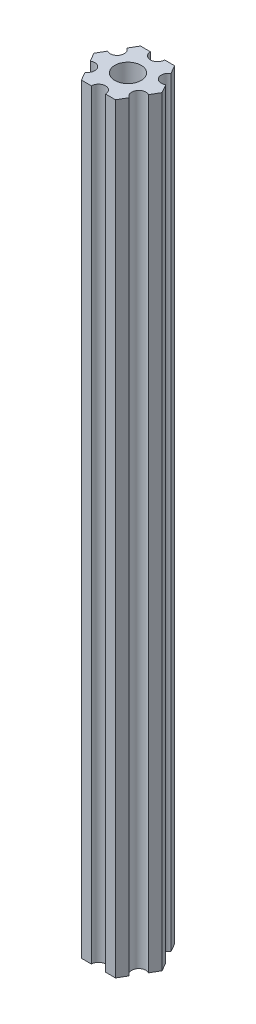
ISO-10303-21;
HEADER;
FILE_DESCRIPTION(('STEP AP214'),'2;1');
FILE_NAME('part.step','',(''),(''),'','','');
FILE_SCHEMA(('AUTOMOTIVE_DESIGN { 1 0 10303 214 1 1 1 1 }'));
ENDSEC;
DATA;
#1=APPLICATION_CONTEXT('core data for automotive mechanical design processes');
#2=APPLICATION_PROTOCOL_DEFINITION('international standard','automotive_design',2000,#1);
#3=PRODUCT_CONTEXT('',#1,'mechanical');
#4=PRODUCT('Part','Part','',(#3));
#5=PRODUCT_RELATED_PRODUCT_CATEGORY('part','',(#4));
#6=PRODUCT_DEFINITION_FORMATION('','',#4);
#7=PRODUCT_DEFINITION_CONTEXT('part definition',#1,'design');
#8=PRODUCT_DEFINITION('design','',#6,#7);
#9=PRODUCT_DEFINITION_SHAPE('','',#8);
#10=(LENGTH_UNIT() NAMED_UNIT(*) SI_UNIT(.MILLI.,.METRE.));
#11=(NAMED_UNIT(*) PLANE_ANGLE_UNIT() SI_UNIT($,.RADIAN.));
#12=(NAMED_UNIT(*) SI_UNIT($,.STERADIAN.) SOLID_ANGLE_UNIT());
#13=UNCERTAINTY_MEASURE_WITH_UNIT(LENGTH_MEASURE(1.E-05),#10,'distance_accuracy_value','');
#14=(GEOMETRIC_REPRESENTATION_CONTEXT(3) GLOBAL_UNCERTAINTY_ASSIGNED_CONTEXT((#13)) GLOBAL_UNIT_ASSIGNED_CONTEXT((#10,
#11,#12)) REPRESENTATION_CONTEXT('',''));
#15=CARTESIAN_POINT('',(0.,0.,0.));
#16=DIRECTION('',(0.,0.,1.));
#17=DIRECTION('',(1.,0.,0.));
#18=AXIS2_PLACEMENT_3D('',#15,#16,#17);
#19=CARTESIAN_POINT('',(5.41265877365274,-76.,3.125));
#20=DIRECTION('',(0.,1.,0.));
#21=DIRECTION('',(0.,0.,1.));
#22=AXIS2_PLACEMENT_3D('',#19,#20,#21);
#23=CYLINDRICAL_SURFACE('',#22,1.5);
#24=CARTESIAN_POINT('',(5.41265877365274,85.,3.125));
#25=DIRECTION('',(0.,-1.,0.));
#26=DIRECTION('',(0.,0.,-1.));
#27=AXIS2_PLACEMENT_3D('',#24,#25,#26);
#28=CIRCLE('',#27,1.5);
#29=CARTESIAN_POINT('',(4.66265877365274,85.,4.42403810567666));
#30=VERTEX_POINT('',#29);
#31=CARTESIAN_POINT('',(6.16265877365274,85.,1.82596189432335));
#32=VERTEX_POINT('',#31);
#33=EDGE_CURVE('E190',#30,#32,#28,.T.);
#34=ORIENTED_EDGE('',*,*,#33,.F.);
#35=DIRECTION('',(0.,1.,0.));
#36=VECTOR('',#35,1.);
#37=CARTESIAN_POINT('',(4.66265877365274,-76.,4.42403810567666));
#38=LINE('',#37,#36);
#39=CARTESIAN_POINT('',(4.66265877365274,-76.,4.42403810567666));
#40=VERTEX_POINT('',#39);
#41=EDGE_CURVE('E11',#40,#30,#38,.T.);
#42=ORIENTED_EDGE('',*,*,#41,.F.);
#43=CARTESIAN_POINT('',(5.41265877365274,-76.,3.125));
#44=DIRECTION('',(0.,-1.,0.));
#45=DIRECTION('',(0.,0.,-1.));
#46=AXIS2_PLACEMENT_3D('',#43,#44,#45);
#47=CIRCLE('',#46,1.5);
#48=CARTESIAN_POINT('',(6.16265877365274,-76.,1.82596189432335));
#49=VERTEX_POINT('',#48);
#50=EDGE_CURVE('E241',#40,#49,#47,.T.);
#51=ORIENTED_EDGE('',*,*,#50,.T.);
#52=DIRECTION('',(0.,1.,0.));
#53=VECTOR('',#52,1.);
#54=CARTESIAN_POINT('',(6.16265877365274,-76.,1.82596189432335));
#55=LINE('',#54,#53);
#56=EDGE_CURVE('E36',#49,#32,#55,.T.);
#57=ORIENTED_EDGE('',*,*,#56,.T.);
#58=EDGE_LOOP('',(#34,#42,#51,#57));
#59=FACE_BOUND('',#58,.T.);
#60=ADVANCED_FACE('F33',(#59),#23,.F.);
#61=CARTESIAN_POINT('',(3.60843918243516,-76.,6.25));
#62=DIRECTION('',(0.866025403784439,0.,0.5));
#63=DIRECTION('',(0.5,0.,-0.866025403784439));
#64=AXIS2_PLACEMENT_3D('',#61,#62,#63);
#65=PLANE('',#64);
#66=DIRECTION('',(0.5,0.,-0.866025403784439));
#67=VECTOR('',#66,1.);
#68=CARTESIAN_POINT('',(3.60843918243516,85.,6.25));
#69=LINE('',#68,#67);
#70=CARTESIAN_POINT('',(3.60843918243516,85.,6.25));
#71=VERTEX_POINT('',#70);
#72=EDGE_CURVE('E239',#71,#30,#69,.T.);
#73=ORIENTED_EDGE('',*,*,#72,.F.);
#74=DIRECTION('',(0.,1.,0.));
#75=VECTOR('',#74,1.);
#76=CARTESIAN_POINT('',(3.60843918243516,-76.,6.25));
#77=LINE('',#76,#75);
#78=CARTESIAN_POINT('',(3.60843918243516,-76.,6.25));
#79=VERTEX_POINT('',#78);
#80=EDGE_CURVE('E42',#79,#71,#77,.T.);
#81=ORIENTED_EDGE('',*,*,#80,.F.);
#82=DIRECTION('',(0.5,0.,-0.866025403784439));
#83=VECTOR('',#82,1.);
#84=CARTESIAN_POINT('',(3.60843918243516,-76.,6.25));
#85=LINE('',#84,#83);
#86=EDGE_CURVE('E180',#79,#40,#85,.T.);
#87=ORIENTED_EDGE('',*,*,#86,.T.);
#88=ORIENTED_EDGE('',*,*,#41,.T.);
#89=EDGE_LOOP('',(#73,#81,#87,#88));
#90=FACE_BOUND('',#89,.T.);
#91=ADVANCED_FACE('F273',(#90),#65,.T.);
#92=CARTESIAN_POINT('',(1.5,-76.,6.25));
#93=DIRECTION('',(0.,0.,1.));
#94=DIRECTION('',(1.,0.,0.));
#95=AXIS2_PLACEMENT_3D('',#92,#93,#94);
#96=PLANE('',#95);
#97=DIRECTION('',(1.,0.,0.));
#98=VECTOR('',#97,1.);
#99=CARTESIAN_POINT('',(1.5,85.,6.25));
#100=LINE('',#99,#98);
#101=CARTESIAN_POINT('',(1.5,85.,6.25));
#102=VERTEX_POINT('',#101);
#103=EDGE_CURVE('E167',#102,#71,#100,.T.);
#104=ORIENTED_EDGE('',*,*,#103,.F.);
#105=DIRECTION('',(0.,1.,0.));
#106=VECTOR('',#105,1.);
#107=CARTESIAN_POINT('',(1.5,-76.,6.25));
#108=LINE('',#107,#106);
#109=CARTESIAN_POINT('',(1.5,-76.,6.25));
#110=VERTEX_POINT('',#109);
#111=EDGE_CURVE('E162',#110,#102,#108,.T.);
#112=ORIENTED_EDGE('',*,*,#111,.F.);
#113=DIRECTION('',(1.,0.,0.));
#114=VECTOR('',#113,1.);
#115=CARTESIAN_POINT('',(1.5,-76.,6.25));
#116=LINE('',#115,#114);
#117=EDGE_CURVE('E165',#110,#79,#116,.T.);
#118=ORIENTED_EDGE('',*,*,#117,.T.);
#119=ORIENTED_EDGE('',*,*,#80,.T.);
#120=EDGE_LOOP('',(#104,#112,#118,#119));
#121=FACE_BOUND('',#120,.T.);
#122=ADVANCED_FACE('F164',(#121),#96,.T.);
#123=CARTESIAN_POINT('',(0.,-76.,6.25));
#124=DIRECTION('',(0.,1.,0.));
#125=DIRECTION('',(0.,0.,1.));
#126=AXIS2_PLACEMENT_3D('',#123,#124,#125);
#127=CYLINDRICAL_SURFACE('',#126,1.5);
#128=CARTESIAN_POINT('',(0.,85.,6.25));
#129=DIRECTION('',(0.,-1.,0.));
#130=DIRECTION('',(0.,0.,-1.));
#131=AXIS2_PLACEMENT_3D('',#128,#129,#130);
#132=CIRCLE('',#131,1.5);
#133=CARTESIAN_POINT('',(-1.5,85.,6.25));
#134=VERTEX_POINT('',#133);
#135=EDGE_CURVE('E236',#134,#102,#132,.T.);
#136=ORIENTED_EDGE('',*,*,#135,.F.);
#137=DIRECTION('',(0.,1.,0.));
#138=VECTOR('',#137,1.);
#139=CARTESIAN_POINT('',(-1.5,-76.,6.25));
#140=LINE('',#139,#138);
#141=CARTESIAN_POINT('',(-1.5,-76.,6.25));
#142=VERTEX_POINT('',#141);
#143=EDGE_CURVE('E172',#142,#134,#140,.T.);
#144=ORIENTED_EDGE('',*,*,#143,.F.);
#145=CARTESIAN_POINT('',(0.,-76.,6.25));
#146=DIRECTION('',(0.,-1.,0.));
#147=DIRECTION('',(0.,0.,-1.));
#148=AXIS2_PLACEMENT_3D('',#145,#146,#147);
#149=CIRCLE('',#148,1.5);
#150=EDGE_CURVE('E178',#142,#110,#149,.T.);
#151=ORIENTED_EDGE('',*,*,#150,.T.);
#152=ORIENTED_EDGE('',*,*,#111,.T.);
#153=EDGE_LOOP('',(#136,#144,#151,#152));
#154=FACE_BOUND('',#153,.T.);
#155=ADVANCED_FACE('F182',(#154),#127,.F.);
#156=CARTESIAN_POINT('',(-3.60843918243516,-76.,6.25));
#157=DIRECTION('',(0.,0.,1.));
#158=DIRECTION('',(1.,0.,0.));
#159=AXIS2_PLACEMENT_3D('',#156,#157,#158);
#160=PLANE('',#159);
#161=DIRECTION('',(1.,0.,0.));
#162=VECTOR('',#161,1.);
#163=CARTESIAN_POINT('',(-3.60843918243516,85.,6.25));
#164=LINE('',#163,#162);
#165=CARTESIAN_POINT('',(-3.60843918243516,85.,6.25));
#166=VERTEX_POINT('',#165);
#167=EDGE_CURVE('E233',#166,#134,#164,.T.);
#168=ORIENTED_EDGE('',*,*,#167,.F.);
#169=DIRECTION('',(0.,1.,0.));
#170=VECTOR('',#169,1.);
#171=CARTESIAN_POINT('',(-3.60843918243516,-76.,6.25));
#172=LINE('',#171,#170);
#173=CARTESIAN_POINT('',(-3.60843918243516,-76.,6.25));
#174=VERTEX_POINT('',#173);
#175=EDGE_CURVE('E245',#174,#166,#172,.T.);
#176=ORIENTED_EDGE('',*,*,#175,.F.);
#177=DIRECTION('',(1.,0.,0.));
#178=VECTOR('',#177,1.);
#179=CARTESIAN_POINT('',(-3.60843918243516,-76.,6.25));
#180=LINE('',#179,#178);
#181=EDGE_CURVE('E183',#174,#142,#180,.T.);
#182=ORIENTED_EDGE('',*,*,#181,.T.);
#183=ORIENTED_EDGE('',*,*,#143,.T.);
#184=EDGE_LOOP('',(#168,#176,#182,#183));
#185=FACE_BOUND('',#184,.T.);
#186=ADVANCED_FACE('F286',(#185),#160,.T.);
#187=CARTESIAN_POINT('',(-4.66265877365274,-76.,4.42403810567666));
#188=DIRECTION('',(-0.866025403784439,0.,0.5));
#189=DIRECTION('',(0.5,0.,0.866025403784439));
#190=AXIS2_PLACEMENT_3D('',#187,#188,#189);
#191=PLANE('',#190);
#192=DIRECTION('',(0.5,0.,0.866025403784439));
#193=VECTOR('',#192,1.);
#194=CARTESIAN_POINT('',(-4.66265877365274,85.,4.42403810567666));
#195=LINE('',#194,#193);
#196=CARTESIAN_POINT('',(-4.66265877365274,85.,4.42403810567666));
#197=VERTEX_POINT('',#196);
#198=EDGE_CURVE('E230',#197,#166,#195,.T.);
#199=ORIENTED_EDGE('',*,*,#198,.F.);
#200=DIRECTION('',(0.,1.,0.));
#201=VECTOR('',#200,1.);
#202=CARTESIAN_POINT('',(-4.66265877365274,-76.,4.42403810567666));
#203=LINE('',#202,#201);
#204=CARTESIAN_POINT('',(-4.66265877365274,-76.,4.42403810567666));
#205=VERTEX_POINT('',#204);
#206=EDGE_CURVE('E247',#205,#197,#203,.T.);
#207=ORIENTED_EDGE('',*,*,#206,.F.);
#208=DIRECTION('',(0.5,0.,0.866025403784439));
#209=VECTOR('',#208,1.);
#210=CARTESIAN_POINT('',(-4.66265877365274,-76.,4.42403810567666));
#211=LINE('',#210,#209);
#212=EDGE_CURVE('E185',#205,#174,#211,.T.);
#213=ORIENTED_EDGE('',*,*,#212,.T.);
#214=ORIENTED_EDGE('',*,*,#175,.T.);
#215=EDGE_LOOP('',(#199,#207,#213,#214));
#216=FACE_BOUND('',#215,.T.);
#217=ADVANCED_FACE('F289',(#216),#191,.T.);
#218=CARTESIAN_POINT('',(-5.41265877365274,-76.,3.125));
#219=DIRECTION('',(0.,1.,0.));
#220=DIRECTION('',(0.,0.,1.));
#221=AXIS2_PLACEMENT_3D('',#218,#219,#220);
#222=CYLINDRICAL_SURFACE('',#221,1.5);
#223=CARTESIAN_POINT('',(-5.41265877365274,85.,3.125));
#224=DIRECTION('',(0.,-1.,0.));
#225=DIRECTION('',(0.,0.,-1.));
#226=AXIS2_PLACEMENT_3D('',#223,#224,#225);
#227=CIRCLE('',#226,1.5);
#228=CARTESIAN_POINT('',(-6.16265877365274,85.,1.82596189432335));
#229=VERTEX_POINT('',#228);
#230=EDGE_CURVE('E227',#229,#197,#227,.T.);
#231=ORIENTED_EDGE('',*,*,#230,.F.);
#232=DIRECTION('',(0.,1.,0.));
#233=VECTOR('',#232,1.);
#234=CARTESIAN_POINT('',(-6.16265877365274,-76.,1.82596189432335));
#235=LINE('',#234,#233);
#236=CARTESIAN_POINT('',(-6.16265877365274,-76.,1.82596189432335));
#237=VERTEX_POINT('',#236);
#238=EDGE_CURVE('E249',#237,#229,#235,.T.);
#239=ORIENTED_EDGE('',*,*,#238,.F.);
#240=CARTESIAN_POINT('',(-5.41265877365274,-76.,3.125));
#241=DIRECTION('',(0.,-1.,0.));
#242=DIRECTION('',(0.,0.,-1.));
#243=AXIS2_PLACEMENT_3D('',#240,#241,#242);
#244=CIRCLE('',#243,1.5);
#245=EDGE_CURVE('E394',#237,#205,#244,.T.);
#246=ORIENTED_EDGE('',*,*,#245,.T.);
#247=ORIENTED_EDGE('',*,*,#206,.T.);
#248=EDGE_LOOP('',(#231,#239,#246,#247));
#249=FACE_BOUND('',#248,.T.);
#250=ADVANCED_FACE('F293',(#249),#222,.F.);
#251=CARTESIAN_POINT('',(-7.21687836487032,-76.,0.));
#252=DIRECTION('',(-0.86602540378444,0.,0.499999999999998));
#253=DIRECTION('',(0.499999999999998,0.,0.86602540378444));
#254=AXIS2_PLACEMENT_3D('',#251,#252,#253);
#255=PLANE('',#254);
#256=DIRECTION('',(0.499999999999998,0.,0.86602540378444));
#257=VECTOR('',#256,1.);
#258=CARTESIAN_POINT('',(-7.21687836487032,85.,0.));
#259=LINE('',#258,#257);
#260=CARTESIAN_POINT('',(-7.21687836487032,85.,0.));
#261=VERTEX_POINT('',#260);
#262=EDGE_CURVE('E224',#261,#229,#259,.T.);
#263=ORIENTED_EDGE('',*,*,#262,.F.);
#264=DIRECTION('',(0.,1.,0.));
#265=VECTOR('',#264,1.);
#266=CARTESIAN_POINT('',(-7.21687836487032,-76.,0.));
#267=LINE('',#266,#265);
#268=CARTESIAN_POINT('',(-7.21687836487032,-76.,0.));
#269=VERTEX_POINT('',#268);
#270=EDGE_CURVE('E251',#269,#261,#267,.T.);
#271=ORIENTED_EDGE('',*,*,#270,.F.);
#272=DIRECTION('',(0.499999999999998,0.,0.86602540378444));
#273=VECTOR('',#272,1.);
#274=CARTESIAN_POINT('',(-7.21687836487032,-76.,0.));
#275=LINE('',#274,#273);
#276=EDGE_CURVE('E391',#269,#237,#275,.T.);
#277=ORIENTED_EDGE('',*,*,#276,.T.);
#278=ORIENTED_EDGE('',*,*,#238,.T.);
#279=EDGE_LOOP('',(#263,#271,#277,#278));
#280=FACE_BOUND('',#279,.T.);
#281=ADVANCED_FACE('F297',(#280),#255,.T.);
#282=CARTESIAN_POINT('',(-6.16265877365274,-76.,-1.82596189432334));
#283=DIRECTION('',(-0.866025403784438,0.,-0.5));
#284=DIRECTION('',(-0.5,0.,0.866025403784438));
#285=AXIS2_PLACEMENT_3D('',#282,#283,#284);
#286=PLANE('',#285);
#287=DIRECTION('',(-0.5,0.,0.866025403784438));
#288=VECTOR('',#287,1.);
#289=CARTESIAN_POINT('',(-6.16265877365274,85.,-1.82596189432334));
#290=LINE('',#289,#288);
#291=CARTESIAN_POINT('',(-6.16265877365274,85.,-1.82596189432334));
#292=VERTEX_POINT('',#291);
#293=EDGE_CURVE('E221',#292,#261,#290,.T.);
#294=ORIENTED_EDGE('',*,*,#293,.F.);
#295=DIRECTION('',(0.,1.,0.));
#296=VECTOR('',#295,1.);
#297=CARTESIAN_POINT('',(-6.16265877365274,-76.,-1.82596189432334));
#298=LINE('',#297,#296);
#299=CARTESIAN_POINT('',(-6.16265877365274,-76.,-1.82596189432334));
#300=VERTEX_POINT('',#299);
#301=EDGE_CURVE('E253',#300,#292,#298,.T.);
#302=ORIENTED_EDGE('',*,*,#301,.F.);
#303=DIRECTION('',(-0.5,0.,0.866025403784438));
#304=VECTOR('',#303,1.);
#305=CARTESIAN_POINT('',(-6.16265877365274,-76.,-1.82596189432334));
#306=LINE('',#305,#304);
#307=EDGE_CURVE('E388',#300,#269,#306,.T.);
#308=ORIENTED_EDGE('',*,*,#307,.T.);
#309=ORIENTED_EDGE('',*,*,#270,.T.);
#310=EDGE_LOOP('',(#294,#302,#308,#309));
#311=FACE_BOUND('',#310,.T.);
#312=ADVANCED_FACE('F301',(#311),#286,.T.);
#313=CARTESIAN_POINT('',(-5.41265877365274,-76.,-3.125));
#314=DIRECTION('',(0.,1.,0.));
#315=DIRECTION('',(0.,0.,1.));
#316=AXIS2_PLACEMENT_3D('',#313,#314,#315);
#317=CYLINDRICAL_SURFACE('',#316,1.5);
#318=CARTESIAN_POINT('',(-5.41265877365274,85.,-3.125));
#319=DIRECTION('',(0.,-1.,0.));
#320=DIRECTION('',(0.,0.,-1.));
#321=AXIS2_PLACEMENT_3D('',#318,#319,#320);
#322=CIRCLE('',#321,1.5);
#323=CARTESIAN_POINT('',(-4.66265877365274,85.,-4.42403810567666));
#324=VERTEX_POINT('',#323);
#325=EDGE_CURVE('E218',#324,#292,#322,.T.);
#326=ORIENTED_EDGE('',*,*,#325,.F.);
#327=DIRECTION('',(0.,1.,0.));
#328=VECTOR('',#327,1.);
#329=CARTESIAN_POINT('',(-4.66265877365274,-76.,-4.42403810567666));
#330=LINE('',#329,#328);
#331=CARTESIAN_POINT('',(-4.66265877365274,-76.,-4.42403810567666));
#332=VERTEX_POINT('',#331);
#333=EDGE_CURVE('E255',#332,#324,#330,.T.);
#334=ORIENTED_EDGE('',*,*,#333,.F.);
#335=CARTESIAN_POINT('',(-5.41265877365274,-76.,-3.125));
#336=DIRECTION('',(0.,-1.,0.));
#337=DIRECTION('',(0.,0.,-1.));
#338=AXIS2_PLACEMENT_3D('',#335,#336,#337);
#339=CIRCLE('',#338,1.5);
#340=EDGE_CURVE('E385',#332,#300,#339,.T.);
#341=ORIENTED_EDGE('',*,*,#340,.T.);
#342=ORIENTED_EDGE('',*,*,#301,.T.);
#343=EDGE_LOOP('',(#326,#334,#341,#342));
#344=FACE_BOUND('',#343,.T.);
#345=ADVANCED_FACE('F305',(#344),#317,.F.);
#346=CARTESIAN_POINT('',(-3.60843918243516,-76.,-6.25));
#347=DIRECTION('',(-0.866025403784439,0.,-0.5));
#348=DIRECTION('',(-0.5,0.,0.866025403784439));
#349=AXIS2_PLACEMENT_3D('',#346,#347,#348);
#350=PLANE('',#349);
#351=DIRECTION('',(-0.5,0.,0.866025403784439));
#352=VECTOR('',#351,1.);
#353=CARTESIAN_POINT('',(-3.60843918243516,85.,-6.25));
#354=LINE('',#353,#352);
#355=CARTESIAN_POINT('',(-3.60843918243516,85.,-6.25));
#356=VERTEX_POINT('',#355);
#357=EDGE_CURVE('E215',#356,#324,#354,.T.);
#358=ORIENTED_EDGE('',*,*,#357,.F.);
#359=DIRECTION('',(0.,1.,0.));
#360=VECTOR('',#359,1.);
#361=CARTESIAN_POINT('',(-3.60843918243516,-76.,-6.25));
#362=LINE('',#361,#360);
#363=CARTESIAN_POINT('',(-3.60843918243516,-76.,-6.25));
#364=VERTEX_POINT('',#363);
#365=EDGE_CURVE('E257',#364,#356,#362,.T.);
#366=ORIENTED_EDGE('',*,*,#365,.F.);
#367=DIRECTION('',(-0.5,0.,0.866025403784439));
#368=VECTOR('',#367,1.);
#369=CARTESIAN_POINT('',(-3.60843918243516,-76.,-6.25));
#370=LINE('',#369,#368);
#371=EDGE_CURVE('E382',#364,#332,#370,.T.);
#372=ORIENTED_EDGE('',*,*,#371,.T.);
#373=ORIENTED_EDGE('',*,*,#333,.T.);
#374=EDGE_LOOP('',(#358,#366,#372,#373));
#375=FACE_BOUND('',#374,.T.);
#376=ADVANCED_FACE('F309',(#375),#350,.T.);
#377=CARTESIAN_POINT('',(-1.5,-76.,-6.25));
#378=DIRECTION('',(0.,0.,-1.));
#379=DIRECTION('',(-1.,0.,0.));
#380=AXIS2_PLACEMENT_3D('',#377,#378,#379);
#381=PLANE('',#380);
#382=DIRECTION('',(-1.,0.,0.));
#383=VECTOR('',#382,1.);
#384=CARTESIAN_POINT('',(-1.5,85.,-6.25));
#385=LINE('',#384,#383);
#386=CARTESIAN_POINT('',(-1.5,85.,-6.25));
#387=VERTEX_POINT('',#386);
#388=EDGE_CURVE('E212',#387,#356,#385,.T.);
#389=ORIENTED_EDGE('',*,*,#388,.F.);
#390=DIRECTION('',(0.,1.,0.));
#391=VECTOR('',#390,1.);
#392=CARTESIAN_POINT('',(-1.5,-76.,-6.25));
#393=LINE('',#392,#391);
#394=CARTESIAN_POINT('',(-1.5,-76.,-6.25));
#395=VERTEX_POINT('',#394);
#396=EDGE_CURVE('E259',#395,#387,#393,.T.);
#397=ORIENTED_EDGE('',*,*,#396,.F.);
#398=DIRECTION('',(-1.,0.,0.));
#399=VECTOR('',#398,1.);
#400=CARTESIAN_POINT('',(-1.5,-76.,-6.25));
#401=LINE('',#400,#399);
#402=EDGE_CURVE('E379',#395,#364,#401,.T.);
#403=ORIENTED_EDGE('',*,*,#402,.T.);
#404=ORIENTED_EDGE('',*,*,#365,.T.);
#405=EDGE_LOOP('',(#389,#397,#403,#404));
#406=FACE_BOUND('',#405,.T.);
#407=ADVANCED_FACE('F313',(#406),#381,.T.);
#408=CARTESIAN_POINT('',(0.,-76.,-6.25));
#409=DIRECTION('',(0.,1.,0.));
#410=DIRECTION('',(0.,0.,1.));
#411=AXIS2_PLACEMENT_3D('',#408,#409,#410);
#412=CYLINDRICAL_SURFACE('',#411,1.5);
#413=CARTESIAN_POINT('',(0.,85.,-6.25));
#414=DIRECTION('',(0.,-1.,0.));
#415=DIRECTION('',(0.,0.,-1.));
#416=AXIS2_PLACEMENT_3D('',#413,#414,#415);
#417=CIRCLE('',#416,1.5);
#418=CARTESIAN_POINT('',(1.5,85.,-6.25));
#419=VERTEX_POINT('',#418);
#420=EDGE_CURVE('E209',#419,#387,#417,.T.);
#421=ORIENTED_EDGE('',*,*,#420,.F.);
#422=DIRECTION('',(0.,1.,0.));
#423=VECTOR('',#422,1.);
#424=CARTESIAN_POINT('',(1.5,-76.,-6.25));
#425=LINE('',#424,#423);
#426=CARTESIAN_POINT('',(1.5,-76.,-6.25));
#427=VERTEX_POINT('',#426);
#428=EDGE_CURVE('E261',#427,#419,#425,.T.);
#429=ORIENTED_EDGE('',*,*,#428,.F.);
#430=CARTESIAN_POINT('',(0.,-76.,-6.25));
#431=DIRECTION('',(0.,-1.,0.));
#432=DIRECTION('',(0.,0.,-1.));
#433=AXIS2_PLACEMENT_3D('',#430,#431,#432);
#434=CIRCLE('',#433,1.5);
#435=EDGE_CURVE('E376',#427,#395,#434,.T.);
#436=ORIENTED_EDGE('',*,*,#435,.T.);
#437=ORIENTED_EDGE('',*,*,#396,.T.);
#438=EDGE_LOOP('',(#421,#429,#436,#437));
#439=FACE_BOUND('',#438,.T.);
#440=ADVANCED_FACE('F317',(#439),#412,.F.);
#441=CARTESIAN_POINT('',(3.60843918243516,-76.,-6.25));
#442=DIRECTION('',(0.,0.,-1.));
#443=DIRECTION('',(-1.,0.,0.));
#444=AXIS2_PLACEMENT_3D('',#441,#442,#443);
#445=PLANE('',#444);
#446=DIRECTION('',(-1.,0.,0.));
#447=VECTOR('',#446,1.);
#448=CARTESIAN_POINT('',(3.60843918243516,85.,-6.25));
#449=LINE('',#448,#447);
#450=CARTESIAN_POINT('',(3.60843918243516,85.,-6.25));
#451=VERTEX_POINT('',#450);
#452=EDGE_CURVE('E206',#451,#419,#449,.T.);
#453=ORIENTED_EDGE('',*,*,#452,.F.);
#454=DIRECTION('',(0.,1.,0.));
#455=VECTOR('',#454,1.);
#456=CARTESIAN_POINT('',(3.60843918243516,-76.,-6.25));
#457=LINE('',#456,#455);
#458=CARTESIAN_POINT('',(3.60843918243516,-76.,-6.25));
#459=VERTEX_POINT('',#458);
#460=EDGE_CURVE('E263',#459,#451,#457,.T.);
#461=ORIENTED_EDGE('',*,*,#460,.F.);
#462=DIRECTION('',(-1.,0.,0.));
#463=VECTOR('',#462,1.);
#464=CARTESIAN_POINT('',(3.60843918243516,-76.,-6.25));
#465=LINE('',#464,#463);
#466=EDGE_CURVE('E373',#459,#427,#465,.T.);
#467=ORIENTED_EDGE('',*,*,#466,.T.);
#468=ORIENTED_EDGE('',*,*,#428,.T.);
#469=EDGE_LOOP('',(#453,#461,#467,#468));
#470=FACE_BOUND('',#469,.T.);
#471=ADVANCED_FACE('F321',(#470),#445,.T.);
#472=CARTESIAN_POINT('',(4.66265877365274,-76.,-4.42403810567666));
#473=DIRECTION('',(0.866025403784439,0.,-0.5));
#474=DIRECTION('',(-0.5,0.,-0.866025403784439));
#475=AXIS2_PLACEMENT_3D('',#472,#473,#474);
#476=PLANE('',#475);
#477=DIRECTION('',(-0.5,0.,-0.866025403784439));
#478=VECTOR('',#477,1.);
#479=CARTESIAN_POINT('',(4.66265877365274,85.,-4.42403810567666));
#480=LINE('',#479,#478);
#481=CARTESIAN_POINT('',(4.66265877365274,85.,-4.42403810567666));
#482=VERTEX_POINT('',#481);
#483=EDGE_CURVE('E203',#482,#451,#480,.T.);
#484=ORIENTED_EDGE('',*,*,#483,.F.);
#485=DIRECTION('',(0.,1.,0.));
#486=VECTOR('',#485,1.);
#487=CARTESIAN_POINT('',(4.66265877365274,-76.,-4.42403810567666));
#488=LINE('',#487,#486);
#489=CARTESIAN_POINT('',(4.66265877365274,-76.,-4.42403810567666));
#490=VERTEX_POINT('',#489);
#491=EDGE_CURVE('E265',#490,#482,#488,.T.);
#492=ORIENTED_EDGE('',*,*,#491,.F.);
#493=DIRECTION('',(-0.5,0.,-0.866025403784439));
#494=VECTOR('',#493,1.);
#495=CARTESIAN_POINT('',(4.66265877365274,-76.,-4.42403810567666));
#496=LINE('',#495,#494);
#497=EDGE_CURVE('E370',#490,#459,#496,.T.);
#498=ORIENTED_EDGE('',*,*,#497,.T.);
#499=ORIENTED_EDGE('',*,*,#460,.T.);
#500=EDGE_LOOP('',(#484,#492,#498,#499));
#501=FACE_BOUND('',#500,.T.);
#502=ADVANCED_FACE('F325',(#501),#476,.T.);
#503=CARTESIAN_POINT('',(5.41265877365274,-76.,-3.125));
#504=DIRECTION('',(0.,1.,0.));
#505=DIRECTION('',(0.,0.,1.));
#506=AXIS2_PLACEMENT_3D('',#503,#504,#505);
#507=CYLINDRICAL_SURFACE('',#506,1.5);
#508=CARTESIAN_POINT('',(5.41265877365274,85.,-3.125));
#509=DIRECTION('',(0.,-1.,0.));
#510=DIRECTION('',(0.,0.,-1.));
#511=AXIS2_PLACEMENT_3D('',#508,#509,#510);
#512=CIRCLE('',#511,1.5);
#513=CARTESIAN_POINT('',(6.16265877365274,85.,-1.82596189432334));
#514=VERTEX_POINT('',#513);
#515=EDGE_CURVE('E200',#514,#482,#512,.T.);
#516=ORIENTED_EDGE('',*,*,#515,.F.);
#517=DIRECTION('',(0.,1.,0.));
#518=VECTOR('',#517,1.);
#519=CARTESIAN_POINT('',(6.16265877365274,-76.,-1.82596189432334));
#520=LINE('',#519,#518);
#521=CARTESIAN_POINT('',(6.16265877365274,-76.,-1.82596189432334));
#522=VERTEX_POINT('',#521);
#523=EDGE_CURVE('E267',#522,#514,#520,.T.);
#524=ORIENTED_EDGE('',*,*,#523,.F.);
#525=CARTESIAN_POINT('',(5.41265877365274,-76.,-3.125));
#526=DIRECTION('',(0.,-1.,0.));
#527=DIRECTION('',(0.,0.,-1.));
#528=AXIS2_PLACEMENT_3D('',#525,#526,#527);
#529=CIRCLE('',#528,1.5);
#530=EDGE_CURVE('E367',#522,#490,#529,.T.);
#531=ORIENTED_EDGE('',*,*,#530,.T.);
#532=ORIENTED_EDGE('',*,*,#491,.T.);
#533=EDGE_LOOP('',(#516,#524,#531,#532));
#534=FACE_BOUND('',#533,.T.);
#535=ADVANCED_FACE('F329',(#534),#507,.F.);
#536=CARTESIAN_POINT('',(7.21687836487032,-76.,0.));
#537=DIRECTION('',(0.866025403784438,0.,-0.5));
#538=DIRECTION('',(-0.5,0.,-0.866025403784439));
#539=AXIS2_PLACEMENT_3D('',#536,#537,#538);
#540=PLANE('',#539);
#541=DIRECTION('',(-0.5,0.,-0.866025403784439));
#542=VECTOR('',#541,1.);
#543=CARTESIAN_POINT('',(7.21687836487032,85.,0.));
#544=LINE('',#543,#542);
#545=CARTESIAN_POINT('',(7.21687836487032,85.,0.));
#546=VERTEX_POINT('',#545);
#547=EDGE_CURVE('E197',#546,#514,#544,.T.);
#548=ORIENTED_EDGE('',*,*,#547,.F.);
#549=DIRECTION('',(0.,1.,0.));
#550=VECTOR('',#549,1.);
#551=CARTESIAN_POINT('',(7.21687836487032,-76.,0.));
#552=LINE('',#551,#550);
#553=CARTESIAN_POINT('',(7.21687836487032,-76.,0.));
#554=VERTEX_POINT('',#553);
#555=EDGE_CURVE('E268',#554,#546,#552,.T.);
#556=ORIENTED_EDGE('',*,*,#555,.F.);
#557=DIRECTION('',(-0.5,0.,-0.866025403784439));
#558=VECTOR('',#557,1.);
#559=CARTESIAN_POINT('',(7.21687836487032,-76.,0.));
#560=LINE('',#559,#558);
#561=EDGE_CURVE('E364',#554,#522,#560,.T.);
#562=ORIENTED_EDGE('',*,*,#561,.T.);
#563=ORIENTED_EDGE('',*,*,#523,.T.);
#564=EDGE_LOOP('',(#548,#556,#562,#563));
#565=FACE_BOUND('',#564,.T.);
#566=ADVANCED_FACE('F333',(#565),#540,.T.);
#567=CARTESIAN_POINT('',(6.16265877365274,-76.,1.82596189432335));
#568=DIRECTION('',(0.866025403784439,0.,0.499999999999999));
#569=DIRECTION('',(0.499999999999999,0.,-0.866025403784439));
#570=AXIS2_PLACEMENT_3D('',#567,#568,#569);
#571=PLANE('',#570);
#572=DIRECTION('',(0.499999999999999,0.,-0.86602540378444));
#573=VECTOR('',#572,1.);
#574=CARTESIAN_POINT('',(6.16265877365274,85.,1.82596189432335));
#575=LINE('',#574,#573);
#576=EDGE_CURVE('E193',#32,#546,#575,.T.);
#577=ORIENTED_EDGE('',*,*,#576,.F.);
#578=ORIENTED_EDGE('',*,*,#56,.F.);
#579=DIRECTION('',(0.499999999999999,0.,-0.86602540378444));
#580=VECTOR('',#579,1.);
#581=CARTESIAN_POINT('',(6.16265877365274,-76.,1.82596189432335));
#582=LINE('',#581,#580);
#583=EDGE_CURVE('E362',#49,#554,#582,.T.);
#584=ORIENTED_EDGE('',*,*,#583,.T.);
#585=ORIENTED_EDGE('',*,*,#555,.T.);
#586=EDGE_LOOP('',(#577,#578,#584,#585));
#587=FACE_BOUND('',#586,.T.);
#588=ADVANCED_FACE('F270',(#587),#571,.T.);
#589=CARTESIAN_POINT('',(5.41265877365274,-76.,3.125));
#590=DIRECTION('',(0.,-1.,0.));
#591=DIRECTION('',(0.,0.,-1.));
#592=AXIS2_PLACEMENT_3D('',#589,#590,#591);
#593=PLANE('',#592);
#594=CARTESIAN_POINT('',(0.,-76.,0.));
#595=DIRECTION('',(0.,1.,0.));
#596=DIRECTION('',(0.,0.,-1.));
#597=AXIS2_PLACEMENT_3D('',#594,#595,#596);
#598=CIRCLE('',#597,2.79);
#599=CARTESIAN_POINT('',(0.,-76.,-2.79));
#600=VERTEX_POINT('',#599);
#601=EDGE_CURVE('E194',#600,#600,#598,.T.);
#602=ORIENTED_EDGE('',*,*,#601,.T.);
#603=EDGE_LOOP('',(#602));
#604=FACE_BOUND('',#603,.T.);
#605=ORIENTED_EDGE('',*,*,#50,.F.);
#606=ORIENTED_EDGE('',*,*,#86,.F.);
#607=ORIENTED_EDGE('',*,*,#117,.F.);
#608=ORIENTED_EDGE('',*,*,#150,.F.);
#609=ORIENTED_EDGE('',*,*,#181,.F.);
#610=ORIENTED_EDGE('',*,*,#212,.F.);
#611=ORIENTED_EDGE('',*,*,#245,.F.);
#612=ORIENTED_EDGE('',*,*,#276,.F.);
#613=ORIENTED_EDGE('',*,*,#307,.F.);
#614=ORIENTED_EDGE('',*,*,#340,.F.);
#615=ORIENTED_EDGE('',*,*,#371,.F.);
#616=ORIENTED_EDGE('',*,*,#402,.F.);
#617=ORIENTED_EDGE('',*,*,#435,.F.);
#618=ORIENTED_EDGE('',*,*,#466,.F.);
#619=ORIENTED_EDGE('',*,*,#497,.F.);
#620=ORIENTED_EDGE('',*,*,#530,.F.);
#621=ORIENTED_EDGE('',*,*,#561,.F.);
#622=ORIENTED_EDGE('',*,*,#583,.F.);
#623=EDGE_LOOP('',(#605,#606,#607,#608,#609,#610,#611,#612,#613,#614,#615,#616,#617,#618,#619,
#620,#621,#622));
#624=FACE_BOUND('',#623,.T.);
#625=ADVANCED_FACE('F176',(#604,#624),#593,.T.);
#626=CARTESIAN_POINT('',(5.41265877365274,85.,3.125));
#627=DIRECTION('',(0.,-1.,0.));
#628=DIRECTION('',(0.,0.,-1.));
#629=AXIS2_PLACEMENT_3D('',#626,#627,#628);
#630=PLANE('',#629);
#631=CARTESIAN_POINT('',(0.,85.,0.));
#632=DIRECTION('',(0.,1.,0.));
#633=DIRECTION('',(0.,0.,-1.));
#634=AXIS2_PLACEMENT_3D('',#631,#632,#633);
#635=CIRCLE('',#634,2.79);
#636=CARTESIAN_POINT('',(0.,85.,-2.79));
#637=VERTEX_POINT('',#636);
#638=EDGE_CURVE('E357',#637,#637,#635,.T.);
#639=ORIENTED_EDGE('',*,*,#638,.F.);
#640=EDGE_LOOP('',(#639));
#641=FACE_BOUND('',#640,.T.);
#642=ORIENTED_EDGE('',*,*,#33,.T.);
#643=ORIENTED_EDGE('',*,*,#576,.T.);
#644=ORIENTED_EDGE('',*,*,#547,.T.);
#645=ORIENTED_EDGE('',*,*,#515,.T.);
#646=ORIENTED_EDGE('',*,*,#483,.T.);
#647=ORIENTED_EDGE('',*,*,#452,.T.);
#648=ORIENTED_EDGE('',*,*,#420,.T.);
#649=ORIENTED_EDGE('',*,*,#388,.T.);
#650=ORIENTED_EDGE('',*,*,#357,.T.);
#651=ORIENTED_EDGE('',*,*,#325,.T.);
#652=ORIENTED_EDGE('',*,*,#293,.T.);
#653=ORIENTED_EDGE('',*,*,#262,.T.);
#654=ORIENTED_EDGE('',*,*,#230,.T.);
#655=ORIENTED_EDGE('',*,*,#198,.T.);
#656=ORIENTED_EDGE('',*,*,#167,.T.);
#657=ORIENTED_EDGE('',*,*,#135,.T.);
#658=ORIENTED_EDGE('',*,*,#103,.T.);
#659=ORIENTED_EDGE('',*,*,#72,.T.);
#660=EDGE_LOOP('',(#642,#643,#644,#645,#646,#647,#648,#649,#650,#651,#652,#653,#654,#655,#656,
#657,#658,#659));
#661=FACE_BOUND('',#660,.T.);
#662=ADVANCED_FACE('F272',(#641,#661),#630,.F.);
#663=CARTESIAN_POINT('',(0.,-76.,0.));
#664=DIRECTION('',(0.,1.,0.));
#665=DIRECTION('',(0.,0.,1.));
#666=AXIS2_PLACEMENT_3D('',#663,#664,#665);
#667=CYLINDRICAL_SURFACE('',#666,2.79);
#668=ORIENTED_EDGE('',*,*,#601,.F.);
#669=EDGE_LOOP('',(#668));
#670=FACE_BOUND('',#669,.T.);
#671=ORIENTED_EDGE('',*,*,#638,.T.);
#672=EDGE_LOOP('',(#671));
#673=FACE_BOUND('',#672,.T.);
#674=ADVANCED_FACE('F345',(#670,#673),#667,.F.);
#675=CLOSED_SHELL('',(#60,#91,#122,#155,#186,#217,#250,#281,#312,#345,#376,#407,#440,#471,#502,
#535,#566,#588,#625,#662,#674));
#676=MANIFOLD_SOLID_BREP('B2',#675);
#677=ADVANCED_BREP_SHAPE_REPRESENTATION('',(#18,#676),#14);
#678=SHAPE_DEFINITION_REPRESENTATION(#9,#677);
ENDSEC;
END-ISO-10303-21;
